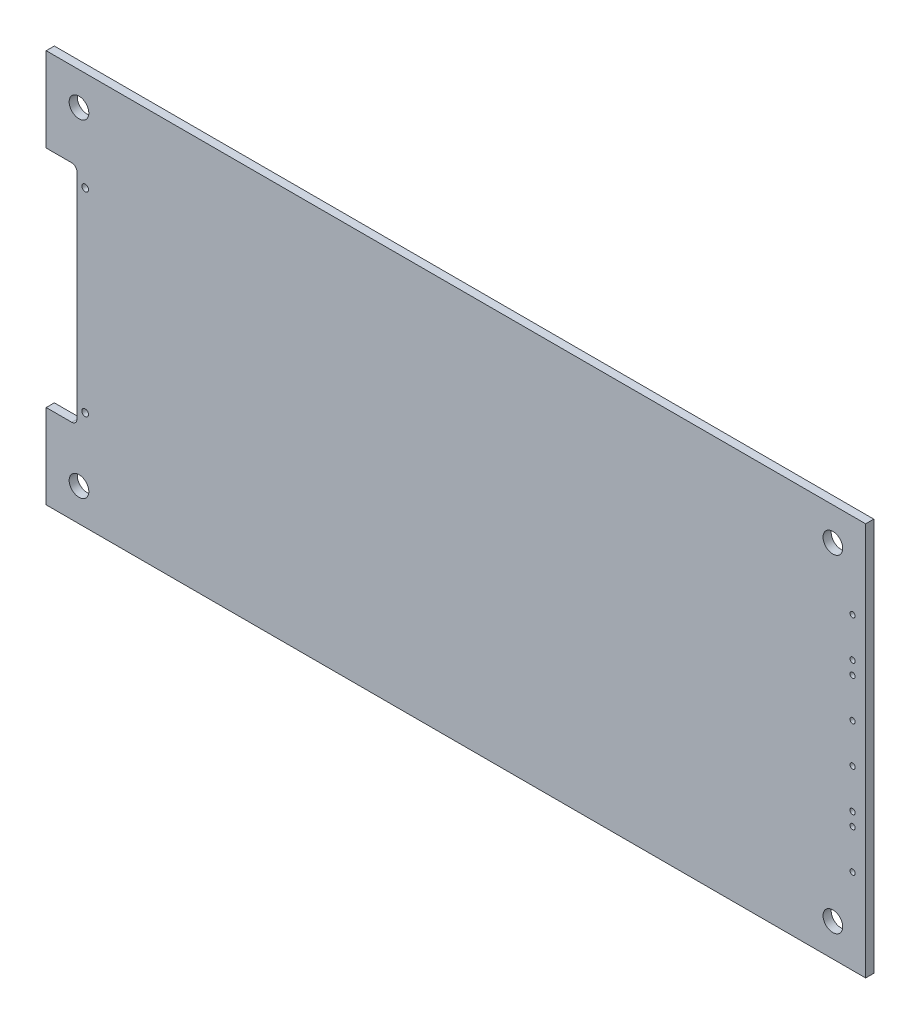
ISO-10303-21;
HEADER;
FILE_DESCRIPTION(('STEP AP214'),'2;1');
FILE_NAME('part.step','',(''),(''),'','','');
FILE_SCHEMA(('AUTOMOTIVE_DESIGN { 1 0 10303 214 1 1 1 1 }'));
ENDSEC;
DATA;
#1=APPLICATION_CONTEXT('core data for automotive mechanical design processes');
#2=APPLICATION_PROTOCOL_DEFINITION('international standard','automotive_design',2000,#1);
#3=PRODUCT_CONTEXT('',#1,'mechanical');
#4=PRODUCT('Part','Part','',(#3));
#5=PRODUCT_RELATED_PRODUCT_CATEGORY('part','',(#4));
#6=PRODUCT_DEFINITION_FORMATION('','',#4);
#7=PRODUCT_DEFINITION_CONTEXT('part definition',#1,'design');
#8=PRODUCT_DEFINITION('design','',#6,#7);
#9=PRODUCT_DEFINITION_SHAPE('','',#8);
#10=(LENGTH_UNIT() NAMED_UNIT(*) SI_UNIT(.MILLI.,.METRE.));
#11=(NAMED_UNIT(*) PLANE_ANGLE_UNIT() SI_UNIT($,.RADIAN.));
#12=(NAMED_UNIT(*) SI_UNIT($,.STERADIAN.) SOLID_ANGLE_UNIT());
#13=UNCERTAINTY_MEASURE_WITH_UNIT(LENGTH_MEASURE(1.E-05),#10,'distance_accuracy_value','');
#14=(GEOMETRIC_REPRESENTATION_CONTEXT(3) GLOBAL_UNCERTAINTY_ASSIGNED_CONTEXT((#13)) GLOBAL_UNIT_ASSIGNED_CONTEXT((#10,
#11,#12)) REPRESENTATION_CONTEXT('',''));
#15=CARTESIAN_POINT('',(0.,0.,0.));
#16=DIRECTION('',(0.,0.,1.));
#17=DIRECTION('',(1.,0.,0.));
#18=AXIS2_PLACEMENT_3D('',#15,#16,#17);
#19=CARTESIAN_POINT('',(0.,0.,1.5748));
#20=DIRECTION('',(1.,0.,0.));
#21=DIRECTION('',(0.,1.,0.));
#22=AXIS2_PLACEMENT_3D('',#19,#20,#21);
#23=PLANE('',#22);
#24=DIRECTION('',(0.,-1.,0.));
#25=VECTOR('',#24,1.);
#26=CARTESIAN_POINT('',(0.,0.,0.));
#27=LINE('',#26,#25);
#28=CARTESIAN_POINT('',(0.,0.,0.));
#29=VERTEX_POINT('',#28);
#30=CARTESIAN_POINT('',(0.,-16.335006,0.));
#31=VERTEX_POINT('',#30);
#32=EDGE_CURVE('E247',#29,#31,#27,.T.);
#33=ORIENTED_EDGE('',*,*,#32,.T.);
#34=DIRECTION('',(0.,0.,1.));
#35=VECTOR('',#34,1.);
#36=CARTESIAN_POINT('',(0.,-16.335006,0.));
#37=LINE('',#36,#35);
#38=CARTESIAN_POINT('',(0.,-16.335006,1.5748));
#39=VERTEX_POINT('',#38);
#40=EDGE_CURVE('E195',#31,#39,#37,.T.);
#41=ORIENTED_EDGE('',*,*,#40,.T.);
#42=DIRECTION('',(0.,-1.,0.));
#43=VECTOR('',#42,1.);
#44=CARTESIAN_POINT('',(0.,0.,1.5748));
#45=LINE('',#44,#43);
#46=CARTESIAN_POINT('',(0.,0.,1.5748));
#47=VERTEX_POINT('',#46);
#48=EDGE_CURVE('E137',#47,#39,#45,.T.);
#49=ORIENTED_EDGE('',*,*,#48,.F.);
#50=DIRECTION('',(0.,0.,-1.));
#51=VECTOR('',#50,1.);
#52=CARTESIAN_POINT('',(0.,0.,1.5748));
#53=LINE('',#52,#51);
#54=EDGE_CURVE('E40',#47,#29,#53,.T.);
#55=ORIENTED_EDGE('',*,*,#54,.T.);
#56=EDGE_LOOP('',(#33,#41,#49,#55));
#57=FACE_BOUND('',#56,.T.);
#58=ADVANCED_FACE('F31',(#57),#23,.F.);
#59=CARTESIAN_POINT('',(158.75,0.,1.5748));
#60=DIRECTION('',(-1.,0.,0.));
#61=DIRECTION('',(0.,0.,1.));
#62=AXIS2_PLACEMENT_3D('',#59,#60,#61);
#63=PLANE('',#62);
#64=DIRECTION('',(0.,1.,0.));
#65=VECTOR('',#64,1.);
#66=CARTESIAN_POINT('',(158.75,0.,0.));
#67=LINE('',#66,#65);
#68=CARTESIAN_POINT('',(158.75,-76.2,0.));
#69=VERTEX_POINT('',#68);
#70=CARTESIAN_POINT('',(158.75,0.,0.));
#71=VERTEX_POINT('',#70);
#72=EDGE_CURVE('E241',#69,#71,#67,.T.);
#73=ORIENTED_EDGE('',*,*,#72,.T.);
#74=DIRECTION('',(0.,0.,-1.));
#75=VECTOR('',#74,1.);
#76=CARTESIAN_POINT('',(158.75,0.,1.5748));
#77=LINE('',#76,#75);
#78=CARTESIAN_POINT('',(158.75,0.,1.5748));
#79=VERTEX_POINT('',#78);
#80=EDGE_CURVE('E11',#79,#71,#77,.T.);
#81=ORIENTED_EDGE('',*,*,#80,.F.);
#82=DIRECTION('',(0.,1.,0.));
#83=VECTOR('',#82,1.);
#84=CARTESIAN_POINT('',(158.75,0.,1.5748));
#85=LINE('',#84,#83);
#86=CARTESIAN_POINT('',(158.75,-76.2,1.5748));
#87=VERTEX_POINT('',#86);
#88=EDGE_CURVE('E141',#87,#79,#85,.T.);
#89=ORIENTED_EDGE('',*,*,#88,.F.);
#90=DIRECTION('',(0.,0.,-1.));
#91=VECTOR('',#90,1.);
#92=CARTESIAN_POINT('',(158.75,-76.2,1.5748));
#93=LINE('',#92,#91);
#94=EDGE_CURVE('E146',#87,#69,#93,.T.);
#95=ORIENTED_EDGE('',*,*,#94,.T.);
#96=EDGE_LOOP('',(#73,#81,#89,#95));
#97=FACE_BOUND('',#96,.T.);
#98=ADVANCED_FACE('F33',(#97),#63,.F.);
#99=CARTESIAN_POINT('',(0.,0.,1.5748));
#100=DIRECTION('',(0.,-1.,0.));
#101=DIRECTION('',(0.,0.,-1.));
#102=AXIS2_PLACEMENT_3D('',#99,#100,#101);
#103=PLANE('',#102);
#104=DIRECTION('',(-1.,0.,0.));
#105=VECTOR('',#104,1.);
#106=CARTESIAN_POINT('',(0.,0.,0.));
#107=LINE('',#106,#105);
#108=EDGE_CURVE('E244',#71,#29,#107,.T.);
#109=ORIENTED_EDGE('',*,*,#108,.T.);
#110=ORIENTED_EDGE('',*,*,#54,.F.);
#111=DIRECTION('',(-1.,0.,0.));
#112=VECTOR('',#111,1.);
#113=CARTESIAN_POINT('',(0.,0.,1.5748));
#114=LINE('',#113,#112);
#115=EDGE_CURVE('E138',#79,#47,#114,.T.);
#116=ORIENTED_EDGE('',*,*,#115,.F.);
#117=ORIENTED_EDGE('',*,*,#80,.T.);
#118=EDGE_LOOP('',(#109,#110,#116,#117));
#119=FACE_BOUND('',#118,.T.);
#120=ADVANCED_FACE('F257',(#119),#103,.F.);
#121=CARTESIAN_POINT('',(0.,-59.865006,1.5748));
#122=VERTEX_POINT('',#121);
#123=CARTESIAN_POINT('',(0.,-76.2,1.5748));
#124=VERTEX_POINT('',#123);
#125=EDGE_CURVE('E127',#122,#124,#45,.T.);
#126=ORIENTED_EDGE('',*,*,#125,.F.);
#127=DIRECTION('',(0.,0.,1.));
#128=VECTOR('',#127,1.);
#129=CARTESIAN_POINT('',(0.,-59.865006,0.));
#130=LINE('',#129,#128);
#131=CARTESIAN_POINT('',(0.,-59.865006,0.));
#132=VERTEX_POINT('',#131);
#133=EDGE_CURVE('E111',#132,#122,#130,.T.);
#134=ORIENTED_EDGE('',*,*,#133,.F.);
#135=CARTESIAN_POINT('',(0.,-76.2,0.));
#136=VERTEX_POINT('',#135);
#137=EDGE_CURVE('E246',#132,#136,#27,.T.);
#138=ORIENTED_EDGE('',*,*,#137,.T.);
#139=DIRECTION('',(0.,0.,-1.));
#140=VECTOR('',#139,1.);
#141=CARTESIAN_POINT('',(0.,-76.2,1.5748));
#142=LINE('',#141,#140);
#143=EDGE_CURVE('E136',#124,#136,#142,.T.);
#144=ORIENTED_EDGE('',*,*,#143,.F.);
#145=EDGE_LOOP('',(#126,#134,#138,#144));
#146=FACE_BOUND('',#145,.T.);
#147=ADVANCED_FACE('F134',(#146),#23,.F.);
#148=CARTESIAN_POINT('',(0.,-76.2,1.5748));
#149=DIRECTION('',(0.,1.,0.));
#150=DIRECTION('',(0.,0.,1.));
#151=AXIS2_PLACEMENT_3D('',#148,#149,#150);
#152=PLANE('',#151);
#153=DIRECTION('',(1.,0.,0.));
#154=VECTOR('',#153,1.);
#155=CARTESIAN_POINT('',(0.,-76.2,0.));
#156=LINE('',#155,#154);
#157=EDGE_CURVE('E250',#136,#69,#156,.T.);
#158=ORIENTED_EDGE('',*,*,#157,.T.);
#159=ORIENTED_EDGE('',*,*,#94,.F.);
#160=DIRECTION('',(1.,0.,0.));
#161=VECTOR('',#160,1.);
#162=CARTESIAN_POINT('',(0.,-76.2,1.5748));
#163=LINE('',#162,#161);
#164=EDGE_CURVE('E56',#124,#87,#163,.T.);
#165=ORIENTED_EDGE('',*,*,#164,.F.);
#166=ORIENTED_EDGE('',*,*,#143,.T.);
#167=EDGE_LOOP('',(#158,#159,#165,#166));
#168=FACE_BOUND('',#167,.T.);
#169=ADVANCED_FACE('F276',(#168),#152,.F.);
#170=CARTESIAN_POINT('',(158.75,-76.2,1.5748));
#171=DIRECTION('',(0.,0.,1.));
#172=DIRECTION('',(1.,0.,0.));
#173=AXIS2_PLACEMENT_3D('',#170,#171,#172);
#174=PLANE('',#173);
#175=CARTESIAN_POINT('',(156.21,-24.13,1.5748));
#176=DIRECTION('',(0.,0.,1.));
#177=DIRECTION('',(1.,0.,0.));
#178=AXIS2_PLACEMENT_3D('',#175,#176,#177);
#179=CIRCLE('',#178,0.508000000000003);
#180=CARTESIAN_POINT('',(156.718,-24.13,1.5748));
#181=VERTEX_POINT('',#180);
#182=EDGE_CURVE('E528',#181,#181,#179,.T.);
#183=ORIENTED_EDGE('',*,*,#182,.F.);
#184=EDGE_LOOP('',(#183));
#185=FACE_BOUND('',#184,.T.);
#186=CARTESIAN_POINT('',(156.21,-26.67,1.5748));
#187=DIRECTION('',(0.,0.,1.));
#188=DIRECTION('',(1.,0.,0.));
#189=AXIS2_PLACEMENT_3D('',#186,#187,#188);
#190=CIRCLE('',#189,0.508000000000003);
#191=CARTESIAN_POINT('',(156.718,-26.67,1.5748));
#192=VERTEX_POINT('',#191);
#193=EDGE_CURVE('E532',#192,#192,#190,.T.);
#194=ORIENTED_EDGE('',*,*,#193,.F.);
#195=EDGE_LOOP('',(#194));
#196=FACE_BOUND('',#195,.T.);
#197=CARTESIAN_POINT('',(156.21,-34.29,1.5748));
#198=DIRECTION('',(0.,0.,1.));
#199=DIRECTION('',(1.,0.,0.));
#200=AXIS2_PLACEMENT_3D('',#197,#198,#199);
#201=CIRCLE('',#200,0.508000000000003);
#202=CARTESIAN_POINT('',(156.718,-34.29,1.5748));
#203=VERTEX_POINT('',#202);
#204=EDGE_CURVE('E541',#203,#203,#201,.T.);
#205=ORIENTED_EDGE('',*,*,#204,.F.);
#206=EDGE_LOOP('',(#205));
#207=FACE_BOUND('',#206,.T.);
#208=CARTESIAN_POINT('',(156.21,-16.51,1.5748));
#209=DIRECTION('',(0.,0.,1.));
#210=DIRECTION('',(1.,0.,0.));
#211=AXIS2_PLACEMENT_3D('',#208,#209,#210);
#212=CIRCLE('',#211,0.508000000000003);
#213=CARTESIAN_POINT('',(156.718,-16.51,1.5748));
#214=VERTEX_POINT('',#213);
#215=EDGE_CURVE('E547',#214,#214,#212,.T.);
#216=ORIENTED_EDGE('',*,*,#215,.F.);
#217=EDGE_LOOP('',(#216));
#218=FACE_BOUND('',#217,.T.);
#219=CARTESIAN_POINT('',(156.21,-41.91,1.5748));
#220=DIRECTION('',(0.,0.,1.));
#221=DIRECTION('',(1.,0.,0.));
#222=AXIS2_PLACEMENT_3D('',#219,#220,#221);
#223=CIRCLE('',#222,0.508000000000003);
#224=CARTESIAN_POINT('',(156.718,-41.91,1.5748));
#225=VERTEX_POINT('',#224);
#226=EDGE_CURVE('E170',#225,#225,#223,.T.);
#227=ORIENTED_EDGE('',*,*,#226,.F.);
#228=EDGE_LOOP('',(#227));
#229=FACE_BOUND('',#228,.T.);
#230=CARTESIAN_POINT('',(156.21,-49.53,1.5748));
#231=DIRECTION('',(0.,0.,1.));
#232=DIRECTION('',(1.,0.,0.));
#233=AXIS2_PLACEMENT_3D('',#230,#231,#232);
#234=CIRCLE('',#233,0.508000000000003);
#235=CARTESIAN_POINT('',(156.718,-49.53,1.5748));
#236=VERTEX_POINT('',#235);
#237=EDGE_CURVE('E160',#236,#236,#234,.T.);
#238=ORIENTED_EDGE('',*,*,#237,.F.);
#239=EDGE_LOOP('',(#238));
#240=FACE_BOUND('',#239,.T.);
#241=CARTESIAN_POINT('',(156.21,-52.07,1.5748));
#242=DIRECTION('',(0.,0.,1.));
#243=DIRECTION('',(1.,0.,0.));
#244=AXIS2_PLACEMENT_3D('',#241,#242,#243);
#245=CIRCLE('',#244,0.508000000000003);
#246=CARTESIAN_POINT('',(156.718,-52.07,1.5748));
#247=VERTEX_POINT('',#246);
#248=EDGE_CURVE('E157',#247,#247,#245,.T.);
#249=ORIENTED_EDGE('',*,*,#248,.F.);
#250=EDGE_LOOP('',(#249));
#251=FACE_BOUND('',#250,.T.);
#252=CARTESIAN_POINT('',(156.21,-59.69,1.5748));
#253=DIRECTION('',(0.,0.,1.));
#254=DIRECTION('',(1.,0.,0.));
#255=AXIS2_PLACEMENT_3D('',#252,#253,#254);
#256=CIRCLE('',#255,0.508000000000003);
#257=CARTESIAN_POINT('',(156.718,-59.69,1.5748));
#258=VERTEX_POINT('',#257);
#259=EDGE_CURVE('E154',#258,#258,#256,.T.);
#260=ORIENTED_EDGE('',*,*,#259,.F.);
#261=EDGE_LOOP('',(#260));
#262=FACE_BOUND('',#261,.T.);
#263=DIRECTION('',(-1.,0.,0.));
#264=VECTOR('',#263,1.);
#265=CARTESIAN_POINT('',(0.,-16.335006,1.5748));
#266=LINE('',#265,#264);
#267=CARTESIAN_POINT('',(4.95,-16.335006,1.5748));
#268=VERTEX_POINT('',#267);
#269=EDGE_CURVE('E183',#268,#39,#266,.T.);
#270=ORIENTED_EDGE('',*,*,#269,.F.);
#271=CARTESIAN_POINT('',(4.95,-17.335006,1.5748));
#272=DIRECTION('',(0.,0.,1.));
#273=DIRECTION('',(-1.,0.,0.));
#274=AXIS2_PLACEMENT_3D('',#271,#272,#273);
#275=CIRCLE('',#274,1.);
#276=CARTESIAN_POINT('',(5.95000000000001,-17.335006,1.5748));
#277=VERTEX_POINT('',#276);
#278=EDGE_CURVE('E180',#277,#268,#275,.T.);
#279=ORIENTED_EDGE('',*,*,#278,.F.);
#280=DIRECTION('',(0.,1.,0.));
#281=VECTOR('',#280,1.);
#282=CARTESIAN_POINT('',(5.95,-58.865006,1.5748));
#283=LINE('',#282,#281);
#284=CARTESIAN_POINT('',(5.95,-58.865006,1.5748));
#285=VERTEX_POINT('',#284);
#286=EDGE_CURVE('E177',#285,#277,#283,.T.);
#287=ORIENTED_EDGE('',*,*,#286,.F.);
#288=CARTESIAN_POINT('',(4.95,-58.865006,1.5748));
#289=DIRECTION('',(0.,0.,1.));
#290=DIRECTION('',(-1.,0.,0.));
#291=AXIS2_PLACEMENT_3D('',#288,#289,#290);
#292=CIRCLE('',#291,1.);
#293=CARTESIAN_POINT('',(4.95,-59.865006,1.5748));
#294=VERTEX_POINT('',#293);
#295=EDGE_CURVE('E131',#294,#285,#292,.T.);
#296=ORIENTED_EDGE('',*,*,#295,.F.);
#297=DIRECTION('',(1.,0.,0.));
#298=VECTOR('',#297,1.);
#299=CARTESIAN_POINT('',(0.,-59.865006,1.5748));
#300=LINE('',#299,#298);
#301=EDGE_CURVE('E114',#122,#294,#300,.T.);
#302=ORIENTED_EDGE('',*,*,#301,.F.);
#303=ORIENTED_EDGE('',*,*,#125,.T.);
#304=ORIENTED_EDGE('',*,*,#164,.T.);
#305=ORIENTED_EDGE('',*,*,#88,.T.);
#306=ORIENTED_EDGE('',*,*,#115,.T.);
#307=ORIENTED_EDGE('',*,*,#48,.T.);
#308=EDGE_LOOP('',(#270,#279,#287,#296,#302,#303,#304,#305,#306,#307));
#309=FACE_BOUND('',#308,.T.);
#310=CARTESIAN_POINT('',(7.55,-56.965088,1.5748));
#311=DIRECTION('',(0.,0.,1.));
#312=DIRECTION('',(1.,0.,0.));
#313=AXIS2_PLACEMENT_3D('',#310,#311,#312);
#314=CIRCLE('',#313,0.649999999999997);
#315=CARTESIAN_POINT('',(8.2,-56.965088,1.5748));
#316=VERTEX_POINT('',#315);
#317=EDGE_CURVE('E198',#316,#316,#314,.T.);
#318=ORIENTED_EDGE('',*,*,#317,.F.);
#319=EDGE_LOOP('',(#318));
#320=FACE_BOUND('',#319,.T.);
#321=CARTESIAN_POINT('',(7.55,-19.234912,1.5748));
#322=DIRECTION('',(0.,0.,1.));
#323=DIRECTION('',(1.,0.,0.));
#324=AXIS2_PLACEMENT_3D('',#321,#322,#323);
#325=CIRCLE('',#324,0.649999999999999);
#326=CARTESIAN_POINT('',(8.2,-19.234912,1.5748));
#327=VERTEX_POINT('',#326);
#328=EDGE_CURVE('E211',#327,#327,#325,.T.);
#329=ORIENTED_EDGE('',*,*,#328,.F.);
#330=EDGE_LOOP('',(#329));
#331=FACE_BOUND('',#330,.T.);
#332=CARTESIAN_POINT('',(6.35,-69.85,1.5748));
#333=DIRECTION('',(0.,0.,1.));
#334=DIRECTION('',(1.,0.,0.));
#335=AXIS2_PLACEMENT_3D('',#332,#333,#334);
#336=CIRCLE('',#335,1.905);
#337=CARTESIAN_POINT('',(8.255,-69.85,1.5748));
#338=VERTEX_POINT('',#337);
#339=EDGE_CURVE('E217',#338,#338,#336,.T.);
#340=ORIENTED_EDGE('',*,*,#339,.F.);
#341=EDGE_LOOP('',(#340));
#342=FACE_BOUND('',#341,.T.);
#343=CARTESIAN_POINT('',(152.4,-69.85,1.5748));
#344=DIRECTION('',(0.,0.,1.));
#345=DIRECTION('',(1.,0.,0.));
#346=AXIS2_PLACEMENT_3D('',#343,#344,#345);
#347=CIRCLE('',#346,1.90499999999999);
#348=CARTESIAN_POINT('',(154.305,-69.85,1.5748));
#349=VERTEX_POINT('',#348);
#350=EDGE_CURVE('E223',#349,#349,#347,.T.);
#351=ORIENTED_EDGE('',*,*,#350,.F.);
#352=EDGE_LOOP('',(#351));
#353=FACE_BOUND('',#352,.T.);
#354=CARTESIAN_POINT('',(6.34999999999999,-6.35,1.5748));
#355=DIRECTION('',(0.,0.,1.));
#356=DIRECTION('',(1.,0.,0.));
#357=AXIS2_PLACEMENT_3D('',#354,#355,#356);
#358=CIRCLE('',#357,1.905);
#359=CARTESIAN_POINT('',(8.255,-6.35,1.5748));
#360=VERTEX_POINT('',#359);
#361=EDGE_CURVE('E229',#360,#360,#358,.T.);
#362=ORIENTED_EDGE('',*,*,#361,.F.);
#363=EDGE_LOOP('',(#362));
#364=FACE_BOUND('',#363,.T.);
#365=CARTESIAN_POINT('',(152.4,-6.34999999999999,1.5748));
#366=DIRECTION('',(0.,0.,1.));
#367=DIRECTION('',(1.,0.,0.));
#368=AXIS2_PLACEMENT_3D('',#365,#366,#367);
#369=CIRCLE('',#368,1.90499999999999);
#370=CARTESIAN_POINT('',(154.305,-6.34999999999999,1.5748));
#371=VERTEX_POINT('',#370);
#372=EDGE_CURVE('E235',#371,#371,#369,.T.);
#373=ORIENTED_EDGE('',*,*,#372,.F.);
#374=EDGE_LOOP('',(#373));
#375=FACE_BOUND('',#374,.T.);
#376=ADVANCED_FACE('F125',(#185,#196,#207,#218,#229,#240,#251,#262,#309,#320,#331,#342,#353,
#364,#375),#174,.T.);
#377=CARTESIAN_POINT('',(158.75,-76.2,0.));
#378=DIRECTION('',(0.,0.,1.));
#379=DIRECTION('',(1.,0.,0.));
#380=AXIS2_PLACEMENT_3D('',#377,#378,#379);
#381=PLANE('',#380);
#382=CARTESIAN_POINT('',(156.21,-24.13,0.));
#383=DIRECTION('',(0.,0.,1.));
#384=DIRECTION('',(1.,0.,0.));
#385=AXIS2_PLACEMENT_3D('',#382,#383,#384);
#386=CIRCLE('',#385,0.508000000000003);
#387=CARTESIAN_POINT('',(156.718,-24.13,0.));
#388=VERTEX_POINT('',#387);
#389=EDGE_CURVE('E531',#388,#388,#386,.T.);
#390=ORIENTED_EDGE('',*,*,#389,.T.);
#391=EDGE_LOOP('',(#390));
#392=FACE_BOUND('',#391,.T.);
#393=CARTESIAN_POINT('',(156.21,-26.67,0.));
#394=DIRECTION('',(0.,0.,1.));
#395=DIRECTION('',(1.,0.,0.));
#396=AXIS2_PLACEMENT_3D('',#393,#394,#395);
#397=CIRCLE('',#396,0.508000000000003);
#398=CARTESIAN_POINT('',(156.718,-26.67,0.));
#399=VERTEX_POINT('',#398);
#400=EDGE_CURVE('E535',#399,#399,#397,.T.);
#401=ORIENTED_EDGE('',*,*,#400,.T.);
#402=EDGE_LOOP('',(#401));
#403=FACE_BOUND('',#402,.T.);
#404=CARTESIAN_POINT('',(156.21,-34.29,0.));
#405=DIRECTION('',(0.,0.,1.));
#406=DIRECTION('',(1.,0.,0.));
#407=AXIS2_PLACEMENT_3D('',#404,#405,#406);
#408=CIRCLE('',#407,0.508000000000003);
#409=CARTESIAN_POINT('',(156.718,-34.29,0.));
#410=VERTEX_POINT('',#409);
#411=EDGE_CURVE('E544',#410,#410,#408,.T.);
#412=ORIENTED_EDGE('',*,*,#411,.T.);
#413=EDGE_LOOP('',(#412));
#414=FACE_BOUND('',#413,.T.);
#415=CARTESIAN_POINT('',(156.21,-16.51,0.));
#416=DIRECTION('',(0.,0.,1.));
#417=DIRECTION('',(1.,0.,0.));
#418=AXIS2_PLACEMENT_3D('',#415,#416,#417);
#419=CIRCLE('',#418,0.508000000000003);
#420=CARTESIAN_POINT('',(156.718,-16.51,0.));
#421=VERTEX_POINT('',#420);
#422=EDGE_CURVE('E549',#421,#421,#419,.T.);
#423=ORIENTED_EDGE('',*,*,#422,.T.);
#424=EDGE_LOOP('',(#423));
#425=FACE_BOUND('',#424,.T.);
#426=CARTESIAN_POINT('',(156.21,-41.91,0.));
#427=DIRECTION('',(0.,0.,1.));
#428=DIRECTION('',(1.,0.,0.));
#429=AXIS2_PLACEMENT_3D('',#426,#427,#428);
#430=CIRCLE('',#429,0.508000000000003);
#431=CARTESIAN_POINT('',(156.718,-41.91,0.));
#432=VERTEX_POINT('',#431);
#433=EDGE_CURVE('E35',#432,#432,#430,.T.);
#434=ORIENTED_EDGE('',*,*,#433,.T.);
#435=EDGE_LOOP('',(#434));
#436=FACE_BOUND('',#435,.T.);
#437=CARTESIAN_POINT('',(156.21,-49.53,0.));
#438=DIRECTION('',(0.,0.,1.));
#439=DIRECTION('',(1.,0.,0.));
#440=AXIS2_PLACEMENT_3D('',#437,#438,#439);
#441=CIRCLE('',#440,0.508000000000003);
#442=CARTESIAN_POINT('',(156.718,-49.53,0.));
#443=VERTEX_POINT('',#442);
#444=EDGE_CURVE('E158',#443,#443,#441,.T.);
#445=ORIENTED_EDGE('',*,*,#444,.T.);
#446=EDGE_LOOP('',(#445));
#447=FACE_BOUND('',#446,.T.);
#448=CARTESIAN_POINT('',(156.21,-52.07,0.));
#449=DIRECTION('',(0.,0.,1.));
#450=DIRECTION('',(1.,0.,0.));
#451=AXIS2_PLACEMENT_3D('',#448,#449,#450);
#452=CIRCLE('',#451,0.508000000000003);
#453=CARTESIAN_POINT('',(156.718,-52.07,0.));
#454=VERTEX_POINT('',#453);
#455=EDGE_CURVE('E155',#454,#454,#452,.T.);
#456=ORIENTED_EDGE('',*,*,#455,.T.);
#457=EDGE_LOOP('',(#456));
#458=FACE_BOUND('',#457,.T.);
#459=CARTESIAN_POINT('',(156.21,-59.69,0.));
#460=DIRECTION('',(0.,0.,1.));
#461=DIRECTION('',(1.,0.,0.));
#462=AXIS2_PLACEMENT_3D('',#459,#460,#461);
#463=CIRCLE('',#462,0.508000000000003);
#464=CARTESIAN_POINT('',(156.718,-59.69,0.));
#465=VERTEX_POINT('',#464);
#466=EDGE_CURVE('E132',#465,#465,#463,.T.);
#467=ORIENTED_EDGE('',*,*,#466,.T.);
#468=EDGE_LOOP('',(#467));
#469=FACE_BOUND('',#468,.T.);
#470=CARTESIAN_POINT('',(7.55,-56.965088,0.));
#471=DIRECTION('',(0.,0.,1.));
#472=DIRECTION('',(1.,0.,0.));
#473=AXIS2_PLACEMENT_3D('',#470,#471,#472);
#474=CIRCLE('',#473,0.649999999999997);
#475=CARTESIAN_POINT('',(8.2,-56.965088,0.));
#476=VERTEX_POINT('',#475);
#477=EDGE_CURVE('E208',#476,#476,#474,.T.);
#478=ORIENTED_EDGE('',*,*,#477,.T.);
#479=EDGE_LOOP('',(#478));
#480=FACE_BOUND('',#479,.T.);
#481=CARTESIAN_POINT('',(7.55,-19.234912,0.));
#482=DIRECTION('',(0.,0.,1.));
#483=DIRECTION('',(1.,0.,0.));
#484=AXIS2_PLACEMENT_3D('',#481,#482,#483);
#485=CIRCLE('',#484,0.649999999999999);
#486=CARTESIAN_POINT('',(8.2,-19.234912,0.));
#487=VERTEX_POINT('',#486);
#488=EDGE_CURVE('E214',#487,#487,#485,.T.);
#489=ORIENTED_EDGE('',*,*,#488,.T.);
#490=EDGE_LOOP('',(#489));
#491=FACE_BOUND('',#490,.T.);
#492=CARTESIAN_POINT('',(6.35,-69.85,0.));
#493=DIRECTION('',(0.,0.,1.));
#494=DIRECTION('',(1.,0.,0.));
#495=AXIS2_PLACEMENT_3D('',#492,#493,#494);
#496=CIRCLE('',#495,1.905);
#497=CARTESIAN_POINT('',(8.255,-69.85,0.));
#498=VERTEX_POINT('',#497);
#499=EDGE_CURVE('E220',#498,#498,#496,.T.);
#500=ORIENTED_EDGE('',*,*,#499,.T.);
#501=EDGE_LOOP('',(#500));
#502=FACE_BOUND('',#501,.T.);
#503=CARTESIAN_POINT('',(152.4,-69.85,0.));
#504=DIRECTION('',(0.,0.,1.));
#505=DIRECTION('',(1.,0.,0.));
#506=AXIS2_PLACEMENT_3D('',#503,#504,#505);
#507=CIRCLE('',#506,1.90499999999999);
#508=CARTESIAN_POINT('',(154.305,-69.85,0.));
#509=VERTEX_POINT('',#508);
#510=EDGE_CURVE('E226',#509,#509,#507,.T.);
#511=ORIENTED_EDGE('',*,*,#510,.T.);
#512=EDGE_LOOP('',(#511));
#513=FACE_BOUND('',#512,.T.);
#514=CARTESIAN_POINT('',(6.34999999999999,-6.35,0.));
#515=DIRECTION('',(0.,0.,1.));
#516=DIRECTION('',(1.,0.,0.));
#517=AXIS2_PLACEMENT_3D('',#514,#515,#516);
#518=CIRCLE('',#517,1.905);
#519=CARTESIAN_POINT('',(8.255,-6.35,0.));
#520=VERTEX_POINT('',#519);
#521=EDGE_CURVE('E232',#520,#520,#518,.T.);
#522=ORIENTED_EDGE('',*,*,#521,.T.);
#523=EDGE_LOOP('',(#522));
#524=FACE_BOUND('',#523,.T.);
#525=CARTESIAN_POINT('',(152.4,-6.34999999999999,0.));
#526=DIRECTION('',(0.,0.,1.));
#527=DIRECTION('',(1.,0.,0.));
#528=AXIS2_PLACEMENT_3D('',#525,#526,#527);
#529=CIRCLE('',#528,1.90499999999999);
#530=CARTESIAN_POINT('',(154.305,-6.34999999999999,0.));
#531=VERTEX_POINT('',#530);
#532=EDGE_CURVE('E238',#531,#531,#529,.T.);
#533=ORIENTED_EDGE('',*,*,#532,.T.);
#534=EDGE_LOOP('',(#533));
#535=FACE_BOUND('',#534,.T.);
#536=CARTESIAN_POINT('',(4.95,-17.335006,0.));
#537=DIRECTION('',(0.,0.,1.));
#538=DIRECTION('',(-1.,0.,0.));
#539=AXIS2_PLACEMENT_3D('',#536,#537,#538);
#540=CIRCLE('',#539,1.);
#541=CARTESIAN_POINT('',(5.95000000000001,-17.335006,0.));
#542=VERTEX_POINT('',#541);
#543=CARTESIAN_POINT('',(4.95,-16.335006,0.));
#544=VERTEX_POINT('',#543);
#545=EDGE_CURVE('E190',#542,#544,#540,.T.);
#546=ORIENTED_EDGE('',*,*,#545,.T.);
#547=DIRECTION('',(-1.,0.,0.));
#548=VECTOR('',#547,1.);
#549=CARTESIAN_POINT('',(0.,-16.335006,0.));
#550=LINE('',#549,#548);
#551=EDGE_CURVE('E122',#544,#31,#550,.T.);
#552=ORIENTED_EDGE('',*,*,#551,.T.);
#553=ORIENTED_EDGE('',*,*,#32,.F.);
#554=ORIENTED_EDGE('',*,*,#108,.F.);
#555=ORIENTED_EDGE('',*,*,#72,.F.);
#556=ORIENTED_EDGE('',*,*,#157,.F.);
#557=ORIENTED_EDGE('',*,*,#137,.F.);
#558=DIRECTION('',(1.,0.,0.));
#559=VECTOR('',#558,1.);
#560=CARTESIAN_POINT('',(0.,-59.865006,0.));
#561=LINE('',#560,#559);
#562=CARTESIAN_POINT('',(4.95000000000001,-59.865006,0.));
#563=VERTEX_POINT('',#562);
#564=EDGE_CURVE('E117',#132,#563,#561,.T.);
#565=ORIENTED_EDGE('',*,*,#564,.T.);
#566=CARTESIAN_POINT('',(4.95,-58.865006,0.));
#567=DIRECTION('',(0.,0.,1.));
#568=DIRECTION('',(-1.,0.,0.));
#569=AXIS2_PLACEMENT_3D('',#566,#567,#568);
#570=CIRCLE('',#569,1.);
#571=CARTESIAN_POINT('',(5.95,-58.865006,0.));
#572=VERTEX_POINT('',#571);
#573=EDGE_CURVE('E48',#563,#572,#570,.T.);
#574=ORIENTED_EDGE('',*,*,#573,.T.);
#575=DIRECTION('',(0.,1.,0.));
#576=VECTOR('',#575,1.);
#577=CARTESIAN_POINT('',(5.95,-58.865006,0.));
#578=LINE('',#577,#576);
#579=EDGE_CURVE('E187',#572,#542,#578,.T.);
#580=ORIENTED_EDGE('',*,*,#579,.T.);
#581=EDGE_LOOP('',(#546,#552,#553,#554,#555,#556,#557,#565,#574,#580));
#582=FACE_BOUND('',#581,.T.);
#583=ADVANCED_FACE('F273',(#392,#403,#414,#425,#436,#447,#458,#469,#480,#491,#502,#513,#524,
#535,#582),#381,.F.);
#584=CARTESIAN_POINT('',(152.4,-6.34999999999999,0.));
#585=DIRECTION('',(0.,0.,1.));
#586=DIRECTION('',(1.,0.,0.));
#587=AXIS2_PLACEMENT_3D('',#584,#585,#586);
#588=CYLINDRICAL_SURFACE('',#587,1.90499999999999);
#589=ORIENTED_EDGE('',*,*,#532,.F.);
#590=EDGE_LOOP('',(#589));
#591=FACE_BOUND('',#590,.T.);
#592=ORIENTED_EDGE('',*,*,#372,.T.);
#593=EDGE_LOOP('',(#592));
#594=FACE_BOUND('',#593,.T.);
#595=ADVANCED_FACE('F422',(#591,#594),#588,.F.);
#596=CARTESIAN_POINT('',(6.34999999999999,-6.35,0.));
#597=DIRECTION('',(0.,0.,1.));
#598=DIRECTION('',(1.,0.,0.));
#599=AXIS2_PLACEMENT_3D('',#596,#597,#598);
#600=CYLINDRICAL_SURFACE('',#599,1.905);
#601=ORIENTED_EDGE('',*,*,#521,.F.);
#602=EDGE_LOOP('',(#601));
#603=FACE_BOUND('',#602,.T.);
#604=ORIENTED_EDGE('',*,*,#361,.T.);
#605=EDGE_LOOP('',(#604));
#606=FACE_BOUND('',#605,.T.);
#607=ADVANCED_FACE('F474',(#603,#606),#600,.F.);
#608=CARTESIAN_POINT('',(152.4,-69.85,0.));
#609=DIRECTION('',(0.,0.,1.));
#610=DIRECTION('',(1.,0.,0.));
#611=AXIS2_PLACEMENT_3D('',#608,#609,#610);
#612=CYLINDRICAL_SURFACE('',#611,1.90499999999999);
#613=ORIENTED_EDGE('',*,*,#510,.F.);
#614=EDGE_LOOP('',(#613));
#615=FACE_BOUND('',#614,.T.);
#616=ORIENTED_EDGE('',*,*,#350,.T.);
#617=EDGE_LOOP('',(#616));
#618=FACE_BOUND('',#617,.T.);
#619=ADVANCED_FACE('F470',(#615,#618),#612,.F.);
#620=CARTESIAN_POINT('',(6.35,-69.85,0.));
#621=DIRECTION('',(0.,0.,1.));
#622=DIRECTION('',(1.,0.,0.));
#623=AXIS2_PLACEMENT_3D('',#620,#621,#622);
#624=CYLINDRICAL_SURFACE('',#623,1.905);
#625=ORIENTED_EDGE('',*,*,#499,.F.);
#626=EDGE_LOOP('',(#625));
#627=FACE_BOUND('',#626,.T.);
#628=ORIENTED_EDGE('',*,*,#339,.T.);
#629=EDGE_LOOP('',(#628));
#630=FACE_BOUND('',#629,.T.);
#631=ADVANCED_FACE('F314',(#627,#630),#624,.F.);
#632=CARTESIAN_POINT('',(7.55,-19.234912,0.));
#633=DIRECTION('',(0.,0.,1.));
#634=DIRECTION('',(1.,0.,0.));
#635=AXIS2_PLACEMENT_3D('',#632,#633,#634);
#636=CYLINDRICAL_SURFACE('',#635,0.649999999999999);
#637=ORIENTED_EDGE('',*,*,#488,.F.);
#638=EDGE_LOOP('',(#637));
#639=FACE_BOUND('',#638,.T.);
#640=ORIENTED_EDGE('',*,*,#328,.T.);
#641=EDGE_LOOP('',(#640));
#642=FACE_BOUND('',#641,.T.);
#643=ADVANCED_FACE('F308',(#639,#642),#636,.F.);
#644=CARTESIAN_POINT('',(7.55,-56.965088,0.));
#645=DIRECTION('',(0.,0.,1.));
#646=DIRECTION('',(1.,0.,0.));
#647=AXIS2_PLACEMENT_3D('',#644,#645,#646);
#648=CYLINDRICAL_SURFACE('',#647,0.649999999999997);
#649=ORIENTED_EDGE('',*,*,#477,.F.);
#650=EDGE_LOOP('',(#649));
#651=FACE_BOUND('',#650,.T.);
#652=ORIENTED_EDGE('',*,*,#317,.T.);
#653=EDGE_LOOP('',(#652));
#654=FACE_BOUND('',#653,.T.);
#655=ADVANCED_FACE('F313',(#651,#654),#648,.F.);
#656=CARTESIAN_POINT('',(0.,-16.335006,0.));
#657=DIRECTION('',(0.,1.,0.));
#658=DIRECTION('',(0.,0.,1.));
#659=AXIS2_PLACEMENT_3D('',#656,#657,#658);
#660=PLANE('',#659);
#661=ORIENTED_EDGE('',*,*,#269,.T.);
#662=ORIENTED_EDGE('',*,*,#40,.F.);
#663=ORIENTED_EDGE('',*,*,#551,.F.);
#664=DIRECTION('',(0.,0.,1.));
#665=VECTOR('',#664,1.);
#666=CARTESIAN_POINT('',(4.95,-16.335006,0.));
#667=LINE('',#666,#665);
#668=EDGE_CURVE('E199',#544,#268,#667,.T.);
#669=ORIENTED_EDGE('',*,*,#668,.T.);
#670=EDGE_LOOP('',(#661,#662,#663,#669));
#671=FACE_BOUND('',#670,.T.);
#672=ADVANCED_FACE('F263',(#671),#660,.F.);
#673=CARTESIAN_POINT('',(4.95,-17.335006,0.));
#674=DIRECTION('',(0.,0.,1.));
#675=DIRECTION('',(1.,0.,0.));
#676=AXIS2_PLACEMENT_3D('',#673,#674,#675);
#677=CYLINDRICAL_SURFACE('',#676,1.);
#678=ORIENTED_EDGE('',*,*,#278,.T.);
#679=ORIENTED_EDGE('',*,*,#668,.F.);
#680=ORIENTED_EDGE('',*,*,#545,.F.);
#681=DIRECTION('',(0.,0.,1.));
#682=VECTOR('',#681,1.);
#683=CARTESIAN_POINT('',(5.95000000000001,-17.335006,0.));
#684=LINE('',#683,#682);
#685=EDGE_CURVE('E201',#542,#277,#684,.T.);
#686=ORIENTED_EDGE('',*,*,#685,.T.);
#687=EDGE_LOOP('',(#678,#679,#680,#686));
#688=FACE_BOUND('',#687,.T.);
#689=ADVANCED_FACE('F267',(#688),#677,.F.);
#690=CARTESIAN_POINT('',(5.95,-58.865006,0.));
#691=DIRECTION('',(1.,0.,0.));
#692=DIRECTION('',(0.,1.,0.));
#693=AXIS2_PLACEMENT_3D('',#690,#691,#692);
#694=PLANE('',#693);
#695=ORIENTED_EDGE('',*,*,#286,.T.);
#696=ORIENTED_EDGE('',*,*,#685,.F.);
#697=ORIENTED_EDGE('',*,*,#579,.F.);
#698=DIRECTION('',(0.,0.,1.));
#699=VECTOR('',#698,1.);
#700=CARTESIAN_POINT('',(5.95,-58.865006,0.));
#701=LINE('',#700,#699);
#702=EDGE_CURVE('E203',#572,#285,#701,.T.);
#703=ORIENTED_EDGE('',*,*,#702,.T.);
#704=EDGE_LOOP('',(#695,#696,#697,#703));
#705=FACE_BOUND('',#704,.T.);
#706=ADVANCED_FACE('F270',(#705),#694,.F.);
#707=CARTESIAN_POINT('',(4.95,-58.865006,0.));
#708=DIRECTION('',(0.,0.,1.));
#709=DIRECTION('',(1.,0.,0.));
#710=AXIS2_PLACEMENT_3D('',#707,#708,#709);
#711=CYLINDRICAL_SURFACE('',#710,1.);
#712=ORIENTED_EDGE('',*,*,#295,.T.);
#713=ORIENTED_EDGE('',*,*,#702,.F.);
#714=ORIENTED_EDGE('',*,*,#573,.F.);
#715=DIRECTION('',(0.,0.,1.));
#716=VECTOR('',#715,1.);
#717=CARTESIAN_POINT('',(4.95,-59.865006,0.));
#718=LINE('',#717,#716);
#719=EDGE_CURVE('E121',#563,#294,#718,.T.);
#720=ORIENTED_EDGE('',*,*,#719,.T.);
#721=EDGE_LOOP('',(#712,#713,#714,#720));
#722=FACE_BOUND('',#721,.T.);
#723=ADVANCED_FACE('F271',(#722),#711,.F.);
#724=CARTESIAN_POINT('',(0.,-59.865006,0.));
#725=DIRECTION('',(0.,-1.,0.));
#726=DIRECTION('',(0.,0.,-1.));
#727=AXIS2_PLACEMENT_3D('',#724,#725,#726);
#728=PLANE('',#727);
#729=ORIENTED_EDGE('',*,*,#301,.T.);
#730=ORIENTED_EDGE('',*,*,#719,.F.);
#731=ORIENTED_EDGE('',*,*,#564,.F.);
#732=ORIENTED_EDGE('',*,*,#133,.T.);
#733=EDGE_LOOP('',(#729,#730,#731,#732));
#734=FACE_BOUND('',#733,.T.);
#735=ADVANCED_FACE('F113',(#734),#728,.F.);
#736=CARTESIAN_POINT('',(156.21,-59.69,-0.9652));
#737=DIRECTION('',(0.,0.,1.));
#738=DIRECTION('',(1.,0.,0.));
#739=AXIS2_PLACEMENT_3D('',#736,#737,#738);
#740=CYLINDRICAL_SURFACE('',#739,0.508000000000003);
#741=ORIENTED_EDGE('',*,*,#259,.T.);
#742=EDGE_LOOP('',(#741));
#743=FACE_BOUND('',#742,.T.);
#744=ORIENTED_EDGE('',*,*,#466,.F.);
#745=EDGE_LOOP('',(#744));
#746=FACE_BOUND('',#745,.T.);
#747=ADVANCED_FACE('F366',(#743,#746),#740,.F.);
#748=CARTESIAN_POINT('',(156.21,-52.07,-0.9652));
#749=DIRECTION('',(0.,0.,1.));
#750=DIRECTION('',(1.,0.,0.));
#751=AXIS2_PLACEMENT_3D('',#748,#749,#750);
#752=CYLINDRICAL_SURFACE('',#751,0.508000000000003);
#753=ORIENTED_EDGE('',*,*,#248,.T.);
#754=EDGE_LOOP('',(#753));
#755=FACE_BOUND('',#754,.T.);
#756=ORIENTED_EDGE('',*,*,#455,.F.);
#757=EDGE_LOOP('',(#756));
#758=FACE_BOUND('',#757,.T.);
#759=ADVANCED_FACE('F375',(#755,#758),#752,.F.);
#760=CARTESIAN_POINT('',(156.21,-49.53,-0.9652));
#761=DIRECTION('',(0.,0.,1.));
#762=DIRECTION('',(1.,0.,0.));
#763=AXIS2_PLACEMENT_3D('',#760,#761,#762);
#764=CYLINDRICAL_SURFACE('',#763,0.508000000000003);
#765=ORIENTED_EDGE('',*,*,#237,.T.);
#766=EDGE_LOOP('',(#765));
#767=FACE_BOUND('',#766,.T.);
#768=ORIENTED_EDGE('',*,*,#444,.F.);
#769=EDGE_LOOP('',(#768));
#770=FACE_BOUND('',#769,.T.);
#771=ADVANCED_FACE('F385',(#767,#770),#764,.F.);
#772=CARTESIAN_POINT('',(156.21,-41.91,-0.9652));
#773=DIRECTION('',(0.,0.,1.));
#774=DIRECTION('',(1.,0.,0.));
#775=AXIS2_PLACEMENT_3D('',#772,#773,#774);
#776=CYLINDRICAL_SURFACE('',#775,0.508000000000003);
#777=ORIENTED_EDGE('',*,*,#226,.T.);
#778=EDGE_LOOP('',(#777));
#779=FACE_BOUND('',#778,.T.);
#780=ORIENTED_EDGE('',*,*,#433,.F.);
#781=EDGE_LOOP('',(#780));
#782=FACE_BOUND('',#781,.T.);
#783=ADVANCED_FACE('F395',(#779,#782),#776,.F.);
#784=CARTESIAN_POINT('',(156.21,-16.51,-0.9652));
#785=DIRECTION('',(0.,0.,1.));
#786=DIRECTION('',(1.,0.,0.));
#787=AXIS2_PLACEMENT_3D('',#784,#785,#786);
#788=CYLINDRICAL_SURFACE('',#787,0.508000000000003);
#789=ORIENTED_EDGE('',*,*,#215,.T.);
#790=EDGE_LOOP('',(#789));
#791=FACE_BOUND('',#790,.T.);
#792=ORIENTED_EDGE('',*,*,#422,.F.);
#793=EDGE_LOOP('',(#792));
#794=FACE_BOUND('',#793,.T.);
#795=ADVANCED_FACE('F404',(#791,#794),#788,.F.);
#796=CARTESIAN_POINT('',(156.21,-34.29,-0.9652));
#797=DIRECTION('',(0.,0.,1.));
#798=DIRECTION('',(1.,0.,0.));
#799=AXIS2_PLACEMENT_3D('',#796,#797,#798);
#800=CYLINDRICAL_SURFACE('',#799,0.508000000000003);
#801=ORIENTED_EDGE('',*,*,#204,.T.);
#802=EDGE_LOOP('',(#801));
#803=FACE_BOUND('',#802,.T.);
#804=ORIENTED_EDGE('',*,*,#411,.F.);
#805=EDGE_LOOP('',(#804));
#806=FACE_BOUND('',#805,.T.);
#807=ADVANCED_FACE('F432',(#803,#806),#800,.F.);
#808=CARTESIAN_POINT('',(156.21,-26.67,-0.9652));
#809=DIRECTION('',(0.,0.,1.));
#810=DIRECTION('',(1.,0.,0.));
#811=AXIS2_PLACEMENT_3D('',#808,#809,#810);
#812=CYLINDRICAL_SURFACE('',#811,0.508000000000003);
#813=ORIENTED_EDGE('',*,*,#193,.T.);
#814=EDGE_LOOP('',(#813));
#815=FACE_BOUND('',#814,.T.);
#816=ORIENTED_EDGE('',*,*,#400,.F.);
#817=EDGE_LOOP('',(#816));
#818=FACE_BOUND('',#817,.T.);
#819=ADVANCED_FACE('F442',(#815,#818),#812,.F.);
#820=CARTESIAN_POINT('',(156.21,-24.13,-0.9652));
#821=DIRECTION('',(0.,0.,1.));
#822=DIRECTION('',(1.,0.,0.));
#823=AXIS2_PLACEMENT_3D('',#820,#821,#822);
#824=CYLINDRICAL_SURFACE('',#823,0.508000000000003);
#825=ORIENTED_EDGE('',*,*,#182,.T.);
#826=EDGE_LOOP('',(#825));
#827=FACE_BOUND('',#826,.T.);
#828=ORIENTED_EDGE('',*,*,#389,.F.);
#829=EDGE_LOOP('',(#828));
#830=FACE_BOUND('',#829,.T.);
#831=ADVANCED_FACE('F452',(#827,#830),#824,.F.);
#832=CLOSED_SHELL('',(#58,#98,#120,#147,#169,#376,#583,#595,#607,#619,#631,#643,#655,#672,#689,
#706,#723,#735,#747,#759,#771,#783,#795,#807,#819,#831));
#833=MANIFOLD_SOLID_BREP('B2',#832);
#834=ADVANCED_BREP_SHAPE_REPRESENTATION('',(#18,#833),#14);
#835=SHAPE_DEFINITION_REPRESENTATION(#9,#834);
ENDSEC;
END-ISO-10303-21;
